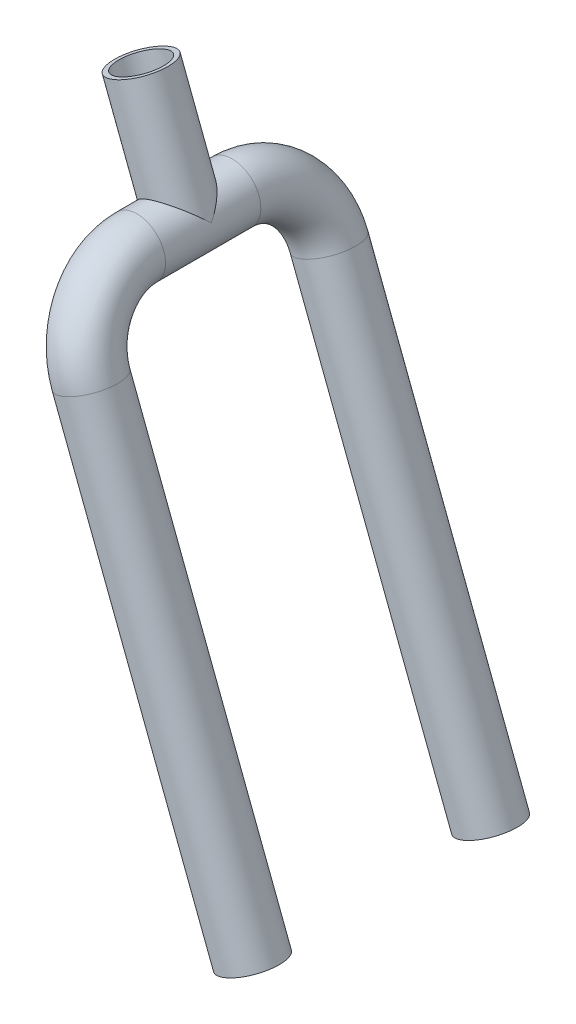
ISO-10303-21;
HEADER;
FILE_DESCRIPTION(('STEP AP214'),'2;1');
FILE_NAME('part.step','',(''),(''),'','','');
FILE_SCHEMA(('AUTOMOTIVE_DESIGN { 1 0 10303 214 1 1 1 1 }'));
ENDSEC;
DATA;
#1=APPLICATION_CONTEXT('core data for automotive mechanical design processes');
#2=APPLICATION_PROTOCOL_DEFINITION('international standard','automotive_design',2000,#1);
#3=PRODUCT_CONTEXT('',#1,'mechanical');
#4=PRODUCT('Part','Part','',(#3));
#5=PRODUCT_RELATED_PRODUCT_CATEGORY('part','',(#4));
#6=PRODUCT_DEFINITION_FORMATION('','',#4);
#7=PRODUCT_DEFINITION_CONTEXT('part definition',#1,'design');
#8=PRODUCT_DEFINITION('design','',#6,#7);
#9=PRODUCT_DEFINITION_SHAPE('','',#8);
#10=(LENGTH_UNIT() NAMED_UNIT(*) SI_UNIT(.MILLI.,.METRE.));
#11=(NAMED_UNIT(*) PLANE_ANGLE_UNIT() SI_UNIT($,.RADIAN.));
#12=(NAMED_UNIT(*) SI_UNIT($,.STERADIAN.) SOLID_ANGLE_UNIT());
#13=UNCERTAINTY_MEASURE_WITH_UNIT(LENGTH_MEASURE(1.E-05),#10,'distance_accuracy_value','');
#14=(GEOMETRIC_REPRESENTATION_CONTEXT(3) GLOBAL_UNCERTAINTY_ASSIGNED_CONTEXT((#13)) GLOBAL_UNIT_ASSIGNED_CONTEXT((#10,
#11,#12)) REPRESENTATION_CONTEXT('',''));
#15=CARTESIAN_POINT('',(0.,0.,0.));
#16=DIRECTION('',(0.,0.,1.));
#17=DIRECTION('',(1.,0.,0.));
#18=AXIS2_PLACEMENT_3D('',#15,#16,#17);
#19=CARTESIAN_POINT('',(310.374349965764,-65.3908633930521,1.17961196366423E-13));
#20=DIRECTION('',(0.356867031977588,-0.934155191329314,0.));
#21=DIRECTION('',(0.934155191329314,0.356867031977588,0.));
#22=AXIS2_PLACEMENT_3D('',#19,#20,#21);
#23=CYLINDRICAL_SURFACE('',#22,12.);
#24=CARTESIAN_POINT('',(310.374349965764,-65.3908633930521,1.17961196366423E-13));
#25=DIRECTION('',(-0.356867031977589,0.934155191329314,0.));
#26=DIRECTION('',(-0.934155191329314,-0.356867031977589,0.));
#27=AXIS2_PLACEMENT_3D('',#24,#25,#26);
#28=CIRCLE('',#27,12.);
#29=CARTESIAN_POINT('',(299.164487669812,-69.6732677767832,1.17961196366423E-13));
#30=VERTEX_POINT('',#29);
#31=EDGE_CURVE('E75',#30,#30,#28,.T.);
#32=ORIENTED_EDGE('',*,*,#31,.F.);
#33=EDGE_LOOP('',(#32));
#34=FACE_BOUND('',#33,.T.);
#35=CARTESIAN_POINT('',(328.626593604482,-113.168961734137,-1.09625249990243E-13));
#36=DIRECTION('',(0.252343098293269,-0.660547470469575,-0.707106781186547));
#37=DIRECTION('',(-0.252343098293269,0.660547470469574,-0.707106781186547));
#38=AXIS2_PLACEMENT_3D('',#35,#36,#37);
#39=ELLIPSE('',#38,16.9705627484771,12.);
#40=CARTESIAN_POINT('',(317.416731308531,-117.451366117868,0.));
#41=VERTEX_POINT('',#40);
#42=CARTESIAN_POINT('',(339.836455900434,-108.886557350406,1.18412093695566E-13));
#43=VERTEX_POINT('',#42);
#44=EDGE_CURVE('E81',#41,#43,#39,.T.);
#45=ORIENTED_EDGE('',*,*,#44,.F.);
#46=CARTESIAN_POINT('',(328.626593604482,-113.168961734137,1.09625249990243E-13));
#47=DIRECTION('',(0.252343098293269,-0.660547470469575,0.707106781186547));
#48=DIRECTION('',(-0.252343098293269,0.660547470469574,0.707106781186547));
#49=AXIS2_PLACEMENT_3D('',#46,#47,#48);
#50=ELLIPSE('',#49,16.9705627484771,12.);
#51=EDGE_CURVE('E12',#43,#41,#50,.T.);
#52=ORIENTED_EDGE('',*,*,#51,.F.);
#53=EDGE_LOOP('',(#45,#52));
#54=FACE_BOUND('',#53,.T.);
#55=ADVANCED_FACE('F60',(#34,#54),#23,.T.);
#56=CARTESIAN_POINT('',(328.626593604482,-113.168961734137,-22.1000000000001));
#57=DIRECTION('',(0.,0.,1.));
#58=DIRECTION('',(1.,0.,0.));
#59=AXIS2_PLACEMENT_3D('',#56,#57,#58);
#60=CYLINDRICAL_SURFACE('',#59,9.99999999999997);
#61=CARTESIAN_POINT('',(328.626593604482,-113.168961734137,20.0000000000001));
#62=DIRECTION('',(0.,0.,-1.));
#63=DIRECTION('',(-0.934155191329314,-0.356867031977588,0.));
#64=AXIS2_PLACEMENT_3D('',#61,#62,#63);
#65=CIRCLE('',#64,9.99999999999997);
#66=CARTESIAN_POINT('',(325.057923284707,-103.827409820844,20.0000000000001));
#67=VERTEX_POINT('',#66);
#68=EDGE_CURVE('E346',#67,#67,#65,.T.);
#69=ORIENTED_EDGE('',*,*,#68,.F.);
#70=EDGE_LOOP('',(#69));
#71=FACE_BOUND('',#70,.T.);
#72=CARTESIAN_POINT('',(338.626593604482,-113.168961734137,7.53229100946376));
#73=CARTESIAN_POINT('',(338.626589763019,-113.484171813911,7.67180583477984));
#74=CARTESIAN_POINT('',(338.611726397505,-113.795319161676,7.82028637291831));
#75=CARTESIAN_POINT('',(338.554088352381,-114.410026195121,8.1275508557588));
#76=CARTESIAN_POINT('',(338.511291185787,-114.713579562976,8.28634300859242));
#77=CARTESIAN_POINT('',(338.398586543403,-115.314129597418,8.60881229461179));
#78=CARTESIAN_POINT('',(338.328597900084,-115.611103792707,8.77250268607406));
#79=CARTESIAN_POINT('',(338.161851545996,-116.197445018467,9.09965396096389));
#80=CARTESIAN_POINT('',(338.065101935073,-116.486814321766,9.2631148988185));
#81=CARTESIAN_POINT('',(337.844523091155,-117.057864871613,9.58614681882761));
#82=CARTESIAN_POINT('',(337.720659406337,-117.339535819546,9.74571256230586));
#83=CARTESIAN_POINT('',(337.445462886541,-117.893709828017,10.0571442340156));
#84=CARTESIAN_POINT('',(337.294125294118,-118.166211291044,10.2090088228619));
#85=CARTESIAN_POINT('',(336.964031739382,-118.699342596713,10.5009872355122));
#86=CARTESIAN_POINT('',(336.785363019411,-118.960006906426,10.6411363286413));
#87=CARTESIAN_POINT('',(336.400012408152,-119.4678040171,10.9065677492897));
#88=CARTESIAN_POINT('',(336.193345052597,-119.714943746608,11.0318577281645));
#89=CARTESIAN_POINT('',(335.820825843123,-120.118295191428,11.2278463985707));
#90=CARTESIAN_POINT('',(335.662247649001,-120.278897508977,11.303410601493));
#91=CARTESIAN_POINT('',(335.332212353992,-120.590970840015,11.4445499183444));
#92=CARTESIAN_POINT('',(335.160758671904,-120.742444258359,11.5101276700484));
#93=CARTESIAN_POINT('',(334.805556689963,-121.03492131751,11.6301275409872));
#94=CARTESIAN_POINT('',(334.621813142466,-121.175928961326,11.6845539396262));
#95=CARTESIAN_POINT('',(334.242796383365,-121.44618536124,11.7812283468518));
#96=CARTESIAN_POINT('',(334.047522851477,-121.575433790433,11.8234760169418));
#97=CARTESIAN_POINT('',(333.645447918093,-121.82153188279,11.8951019602312));
#98=CARTESIAN_POINT('',(333.438586653465,-121.938305928738,11.924404788497));
#99=CARTESIAN_POINT('',(333.015860845385,-122.157342874665,11.9691146112919));
#100=CARTESIAN_POINT('',(332.799996322599,-122.259605807953,11.9845216377166));
#101=CARTESIAN_POINT('',(332.361068362138,-122.448551024011,12.0010716221193));
#102=CARTESIAN_POINT('',(332.138006305354,-122.535236274738,12.0022173001038));
#103=CARTESIAN_POINT('',(331.68659257531,-122.692275559668,11.9902225686271));
#104=CARTESIAN_POINT('',(331.458241217419,-122.762630564799,11.9770830087699));
#105=CARTESIAN_POINT('',(331.018627905023,-122.881084459179,11.9386201390567));
#106=CARTESIAN_POINT('',(330.80764160177,-122.93060179112,11.914477728772));
#107=CARTESIAN_POINT('',(330.384352230874,-123.015631201067,11.8550446762054));
#108=CARTESIAN_POINT('',(330.172048741892,-123.051138535137,11.8197502650083));
#109=CARTESIAN_POINT('',(329.74765996961,-123.108229458829,11.7386683632756));
#110=CARTESIAN_POINT('',(329.535574638839,-123.129817398832,11.6928841572992));
#111=CARTESIAN_POINT('',(329.112724364647,-123.15938831132,11.5915732154755));
#112=CARTESIAN_POINT('',(328.901959949205,-123.167366151221,11.536042812885));
#113=CARTESIAN_POINT('',(328.471698939045,-123.170197580737,11.4129024245151));
#114=CARTESIAN_POINT('',(328.252336882049,-123.164327759883,11.3448058137348));
#115=CARTESIAN_POINT('',(327.81734594446,-123.138547935157,11.1998243930018));
#116=CARTESIAN_POINT('',(327.601718565883,-123.118632410815,11.1229361375736));
#117=CARTESIAN_POINT('',(326.961657664653,-123.038750497619,10.8806611451848));
#118=CARTESIAN_POINT('',(326.543936283196,-122.958648881244,10.7036321717294));
#119=CARTESIAN_POINT('',(325.838829497353,-122.777496876574,10.3770783719235));
#120=CARTESIAN_POINT('',(325.546084446191,-122.687514433541,10.2325834659381));
#121=CARTESIAN_POINT('',(324.973787202938,-122.482893244921,9.93478798481263));
#122=CARTESIAN_POINT('',(324.694240680018,-122.368244019598,9.78148368733595));
#123=CARTESIAN_POINT('',(324.14849657261,-122.115321686843,9.4691447982308));
#124=CARTESIAN_POINT('',(323.882330750781,-121.976995512217,9.31009798187645));
#125=CARTESIAN_POINT('',(323.364341464427,-121.677672964465,8.99015981791156));
#126=CARTESIAN_POINT('',(323.11251450566,-121.516682147985,8.82926893126279));
#127=CARTESIAN_POINT('',(322.659170189583,-121.197352602385,8.53303260666917));
#128=CARTESIAN_POINT('',(322.455683340559,-121.042073147398,8.39739424371055));
#129=CARTESIAN_POINT('',(322.059418003785,-120.714707882957,8.13065097685777));
#130=CARTESIAN_POINT('',(321.866641414875,-120.542619108173,7.99954687839585));
#131=CARTESIAN_POINT('',(321.492685924246,-120.18143165365,7.74595501160012));
#132=CARTESIAN_POINT('',(321.311478823708,-119.992377263064,7.62344621528988));
#133=CARTESIAN_POINT('',(320.961058618337,-119.596211566105,7.39155024012015));
#134=CARTESIAN_POINT('',(320.791837561466,-119.389112438689,7.28215432763324));
#135=CARTESIAN_POINT('',(320.431887175554,-118.909561486385,7.06115903362332));
#136=CARTESIAN_POINT('',(320.244237741966,-118.63257809052,6.95403924319055));
#137=CARTESIAN_POINT('',(319.981084151325,-118.197273203431,6.82439325740273));
#138=CARTESIAN_POINT('',(319.896469268141,-118.048970465991,6.78636501812124));
#139=CARTESIAN_POINT('',(319.7340188431,-117.746250531445,6.72215813494575));
#140=CARTESIAN_POINT('',(319.656179807509,-117.591836545861,6.69597335480149));
#141=CARTESIAN_POINT('',(319.507319483769,-117.276221386052,6.65650697953526));
#142=CARTESIAN_POINT('',(319.43637371925,-117.114967975203,6.6433563326325));
#143=CARTESIAN_POINT('',(319.302954612811,-116.788471304091,6.63112858462126));
#144=CARTESIAN_POINT('',(319.240480824887,-116.623228254401,6.63205074236739));
#145=CARTESIAN_POINT('',(319.124525293708,-116.290150720479,6.64792258439299));
#146=CARTESIAN_POINT('',(319.071050329812,-116.122314385574,6.66288278908353));
#147=CARTESIAN_POINT('',(318.97342216899,-115.78564312116,6.70603823928555));
#148=CARTESIAN_POINT('',(318.929270417708,-115.616808040954,6.7342355351381));
#149=CARTESIAN_POINT('',(318.843334729031,-115.249674983019,6.8085200834707));
#150=CARTESIAN_POINT('',(318.803335556125,-115.05142201435,6.85688269989488));
#151=CARTESIAN_POINT('',(318.735826127546,-114.65654561825,6.96736661682238));
#152=CARTESIAN_POINT('',(318.708325812501,-114.459923609537,7.02949881037299));
#153=CARTESIAN_POINT('',(318.665202490302,-114.068698854289,7.16492680065282));
#154=CARTESIAN_POINT('',(318.649611272783,-113.87410287057,7.23825185422052));
#155=CARTESIAN_POINT('',(318.629809689433,-113.487862552535,7.39341724620991));
#156=CARTESIAN_POINT('',(318.625596569867,-113.296217515195,7.47525551927713));
#157=CARTESIAN_POINT('',(318.628689407725,-112.804007306253,7.69531948253971));
#158=CARTESIAN_POINT('',(318.644224645223,-112.505652990336,7.83840732876916));
#159=CARTESIAN_POINT('',(318.700973996099,-111.916026437965,8.13386391465272));
#160=CARTESIAN_POINT('',(318.742202381246,-111.624758231123,8.28623776993565));
#161=CARTESIAN_POINT('',(318.849554849022,-111.048718312547,8.59531673802817));
#162=CARTESIAN_POINT('',(318.915710615317,-110.763955359869,8.75202712686791));
#163=CARTESIAN_POINT('',(319.072603835049,-110.20138236173,9.06546755198144));
#164=CARTESIAN_POINT('',(319.163336404421,-109.923570946783,9.22219757817384));
#165=CARTESIAN_POINT('',(319.373373360448,-109.364984333964,9.53804936224931));
#166=CARTESIAN_POINT('',(319.493621342945,-109.084488457514,9.69704051797406));
#167=CARTESIAN_POINT('',(319.761139636039,-108.532388442919,10.0077989944249));
#168=CARTESIAN_POINT('',(319.908414622027,-108.260785852814,10.1595650595556));
#169=CARTESIAN_POINT('',(320.230057797878,-107.728875040707,10.4520036433285));
#170=CARTESIAN_POINT('',(320.404359095962,-107.468540910604,10.5927022922514));
#171=CARTESIAN_POINT('',(320.780597997259,-106.960898983082,10.859853953605));
#172=CARTESIAN_POINT('',(320.982522037875,-106.713584874931,10.986313901941));
#173=CARTESIAN_POINT('',(321.348731660222,-106.307232031007,11.1859295826452));
#174=CARTESIAN_POINT('',(321.505990727856,-106.14407354513,11.263655811169));
#175=CARTESIAN_POINT('',(321.83362639437,-105.826784549289,11.4091991129172));
#176=CARTESIAN_POINT('',(322.003999563278,-105.67265169713,11.4770187638343));
#177=CARTESIAN_POINT('',(322.357300190246,-105.374776754331,11.6015425746027));
#178=CARTESIAN_POINT('',(322.540221682557,-105.231029791845,11.6582519677406));
#179=CARTESIAN_POINT('',(322.917901976941,-104.955222683503,11.7594990001698));
#180=CARTESIAN_POINT('',(323.112661085267,-104.823162840225,11.8040363243912));
#181=CARTESIAN_POINT('',(323.514111915047,-104.57134529812,11.8802254189314));
#182=CARTESIAN_POINT('',(323.720869151096,-104.451667516491,11.9117969685809));
#183=CARTESIAN_POINT('',(324.143752999309,-104.226843556653,11.960936903738));
#184=CARTESIAN_POINT('',(324.359879595776,-104.121697354097,11.9785053127062));
#185=CARTESIAN_POINT('',(324.799687390263,-103.927067803824,11.9992145835099));
#186=CARTESIAN_POINT('',(325.023366821068,-103.837580822038,12.0023587970816));
#187=CARTESIAN_POINT('',(325.476358178866,-103.675073771866,11.9941501990527));
#188=CARTESIAN_POINT('',(325.705669733156,-103.602052617094,11.9827983442053));
#189=CARTESIAN_POINT('',(326.146288703288,-103.478996108376,11.9476045270564));
#190=CARTESIAN_POINT('',(326.357279171283,-103.427451593043,11.9250270632346));
#191=CARTESIAN_POINT('',(326.780783369539,-103.338406348836,11.8686172952186));
#192=CARTESIAN_POINT('',(326.99329758973,-103.300910364207,11.834781196208));
#193=CARTESIAN_POINT('',(327.418306985641,-103.239907049377,11.7564859159368));
#194=CARTESIAN_POINT('',(327.630802153803,-103.216396383057,11.7120292716968));
#195=CARTESIAN_POINT('',(328.054628595218,-103.183068275754,11.6132335447811));
#196=CARTESIAN_POINT('',(328.265959398155,-103.17325601419,11.5588907328813));
#197=CARTESIAN_POINT('',(328.696291862998,-103.166781182208,11.4383812730729));
#198=CARTESIAN_POINT('',(328.915180125406,-103.170766438256,11.3717750947005));
#199=CARTESIAN_POINT('',(329.349377077678,-103.192745129391,11.229705016505));
#200=CARTESIAN_POINT('',(329.564684329587,-103.210744059279,11.154237652044));
#201=CARTESIAN_POINT('',(330.203815073776,-103.284826473281,10.9161644508458));
#202=CARTESIAN_POINT('',(330.621139608896,-103.360992803062,10.7418036392201));
#203=CARTESIAN_POINT('',(331.325243593668,-103.535067851445,10.419842720157));
#204=CARTESIAN_POINT('',(331.617312717482,-103.621867318845,10.2773941798534));
#205=CARTESIAN_POINT('',(332.188509801944,-103.819946220552,9.98347104388505));
#206=CARTESIAN_POINT('',(332.467632480365,-103.931235542318,9.83199282066549));
#207=CARTESIAN_POINT('',(333.013279938414,-104.17746578502,9.52271507071044));
#208=CARTESIAN_POINT('',(333.279747379896,-104.312503323735,9.36489183469433));
#209=CARTESIAN_POINT('',(333.798514260618,-104.605089710884,9.04699258920519));
#210=CARTESIAN_POINT('',(334.050816126094,-104.762634687828,8.88691697142301));
#211=CARTESIAN_POINT('',(334.545605389452,-105.103158783915,8.56542477480938));
#212=CARTESIAN_POINT('',(334.787827152795,-105.286552171269,8.40403762915743));
#213=CARTESIAN_POINT('',(335.257257181791,-105.677127642336,8.08776953043228));
#214=CARTESIAN_POINT('',(335.484456725316,-105.884323358228,7.93289237584071));
#215=CARTESIAN_POINT('',(335.921759459393,-106.322366157856,7.63703896319819));
#216=CARTESIAN_POINT('',(336.131949755626,-106.55307698283,7.49599097826109));
#217=CARTESIAN_POINT('',(336.53484744318,-107.040411310566,7.23560127150269));
#218=CARTESIAN_POINT('',(336.727581925956,-107.296993306146,7.11622561451312));
#219=CARTESIAN_POINT('',(337.000088584019,-107.699917819928,6.96243650761092));
#220=CARTESIAN_POINT('',(337.087656332337,-107.836317457144,6.91560380479042));
#221=CARTESIAN_POINT('',(337.257210009238,-108.115340828357,6.83143518745524));
#222=CARTESIAN_POINT('',(337.339198384285,-108.257961788794,6.7940950906802));
#223=CARTESIAN_POINT('',(337.496795518838,-108.548702114777,6.73037850918098));
#224=CARTESIAN_POINT('',(337.572416751697,-108.696809870822,6.70398017139962));
#225=CARTESIAN_POINT('',(337.716745628401,-108.997989183976,6.66320541964865));
#226=CARTESIAN_POINT('',(337.785453415442,-109.151060638187,6.64882875663144));
#227=CARTESIAN_POINT('',(337.915631615412,-109.461898963435,6.63275706246865));
#228=CARTESIAN_POINT('',(337.977060491025,-109.619686897907,6.6311316581695));
#229=CARTESIAN_POINT('',(338.091704402397,-109.937820919372,6.64082869774301));
#230=CARTESIAN_POINT('',(338.144919373909,-110.098167026364,6.65215124288638));
#231=CARTESIAN_POINT('',(338.242891080261,-110.420289687409,6.68720059485624));
#232=CARTESIAN_POINT('',(338.287637089953,-110.582067787262,6.71094298900244));
#233=CARTESIAN_POINT('',(338.368550267593,-110.905743798389,6.76974706854586));
#234=CARTESIAN_POINT('',(338.404713278236,-111.067641729776,6.80481421992586));
#235=CARTESIAN_POINT('',(338.501694715654,-111.558149344779,6.92642035979892));
#236=CARTESIAN_POINT('',(338.549207171322,-111.885589273893,7.02863182335554));
#237=CARTESIAN_POINT('',(338.611674686681,-112.533038858897,7.26163832331369));
#238=CARTESIAN_POINT('',(338.626597454609,-112.853040834583,7.39246156889959));
#239=CARTESIAN_POINT('',(338.626593604482,-113.168961734137,7.53229100946376));
#240=B_SPLINE_CURVE_WITH_KNOTS('',3,(#72,#73,#74,#75,#76,#77,#78,#79,#80,#81,#82,#83,#84,#85,
#86,#87,#88,#89,#90,#91,#92,#93,#94,#95,#96,#97,#98,#99,#100,#101,#102,#103,#104,#105,#106,#107,
#108,#109,#110,#111,#112,#113,#114,#115,#116,#117,#118,#119,#120,#121,#122,#123,#124,#125,#126,
#127,#128,#129,#130,#131,#132,#133,#134,#135,#136,#137,#138,#139,#140,#141,#142,#143,#144,#145,
#146,#147,#148,#149,#150,#151,#152,#153,#154,#155,#156,#157,#158,#159,#160,#161,#162,#163,#164,
#165,#166,#167,#168,#169,#170,#171,#172,#173,#174,#175,#176,#177,#178,#179,#180,#181,#182,#183,
#184,#185,#186,#187,#188,#189,#190,#191,#192,#193,#194,#195,#196,#197,#198,#199,#200,#201,#202,
#203,#204,#205,#206,#207,#208,#209,#210,#211,#212,#213,#214,#215,#216,#217,#218,#219,#220,#221,
#222,#223,#224,#225,#226,#227,#228,#229,#230,#231,#232,#233,#234,#235,#236,#237,#238,#239),
.UNSPECIFIED.,.T.,.F.,(4,2,2,2,2,2,2,2,2,2,2,2,2,2,2,2,2,2,2,2,2,2,2,2,2,2,2,2,2,2,2,2,2,2,2,2,
2,2,2,2,2,2,2,2,2,2,2,2,2,2,2,2,2,2,2,2,2,2,2,2,2,2,2,2,2,2,2,2,2,2,2,2,2,2,2,2,2,2,2,2,2,2,2,
4),(0.,1.03366952312707,2.06817218842973,3.1057869055251,4.1430879067434,5.18171465924484,
6.22052143454877,7.2560789344499,8.29110086133979,9.00448821858774,9.71768681695064,
10.4306112059589,11.1435554081404,11.8606016599185,12.5776462658356,13.2945541107901,
14.0114193205074,14.664855527546,15.3185128056304,15.9719656899165,16.6256649472631,
17.3142636166476,18.0031330811769,19.3805340139431,20.3952884599576,21.4104748809411,
22.4279671705767,23.4452104366833,24.3135972189509,25.1821374707519,26.0484729052802,
26.9142280864254,27.9641109736937,28.4883644944161,29.0123460805481,29.5415400800688,
30.0707062096406,30.6002692245575,31.1299142924897,31.7527882657878,32.3761567619446,
33.0011834917593,33.6260589386935,34.618338464827,35.6111696641826,36.605267070712,
37.5991670683946,38.6303266898309,39.6616648596257,40.6904899928109,41.718811780157,
42.436860462738,43.1547219748784,43.8722445340128,44.5897856642166,45.3117017411652,
46.0336166086193,46.7553637169175,47.4770631917345,48.1314105773129,48.7859787398971,
49.4403906962471,50.0950500212704,50.7808557410982,51.4669305028402,52.8381766999548,
53.846070524946,54.8543720229439,55.8668748461897,56.8792037187422,57.910139773944,
58.9416692432004,59.9675289376738,60.9917681895309,61.4975379831424,62.0030845565731,
62.5076165216154,63.0121380342383,63.5194125266588,64.0266909866882,64.5346076307772,
65.0427697921232,66.0777452594238,67.1137457763556),.UNSPECIFIED.);
#241=CARTESIAN_POINT('',(338.626593604482,-113.168961734137,7.53229100946376));
#242=VERTEX_POINT('',#241);
#243=EDGE_CURVE('E65',#242,#242,#240,.T.);
#244=ORIENTED_EDGE('',*,*,#243,.T.);
#245=EDGE_LOOP('',(#244));
#246=FACE_BOUND('',#245,.T.);
#247=ADVANCED_FACE('F168',(#71,#246),#60,.F.);
#248=CARTESIAN_POINT('',(407.137340639552,-318.683103826586,50.));
#249=DIRECTION('',(-0.356867031977589,0.934155191329314,0.));
#250=DIRECTION('',(-0.934155191329314,-0.356867031977589,0.));
#251=AXIS2_PLACEMENT_3D('',#248,#249,#250);
#252=PLANE('',#251);
#253=CARTESIAN_POINT('',(407.137340639552,-318.683103826586,50.));
#254=DIRECTION('',(-0.356867031977589,0.934155191329314,0.));
#255=DIRECTION('',(-0.934155191329314,-0.356867031977589,0.));
#256=AXIS2_PLACEMENT_3D('',#253,#254,#255);
#257=CIRCLE('',#256,9.99999999999997);
#258=CARTESIAN_POINT('',(397.795788726259,-322.251774146362,50.));
#259=VERTEX_POINT('',#258);
#260=EDGE_CURVE('E352',#259,#259,#257,.T.);
#261=ORIENTED_EDGE('',*,*,#260,.T.);
#262=EDGE_LOOP('',(#261));
#263=FACE_BOUND('',#262,.T.);
#264=CARTESIAN_POINT('',(407.137340639552,-318.683103826586,50.));
#265=DIRECTION('',(-0.356867031977589,0.934155191329314,0.));
#266=DIRECTION('',(-0.934155191329314,-0.356867031977589,0.));
#267=AXIS2_PLACEMENT_3D('',#264,#265,#266);
#268=CIRCLE('',#267,12.);
#269=CARTESIAN_POINT('',(395.9274783436,-322.965508210317,50.));
#270=VERTEX_POINT('',#269);
#271=EDGE_CURVE('E96',#270,#270,#268,.T.);
#272=ORIENTED_EDGE('',*,*,#271,.F.);
#273=EDGE_LOOP('',(#272));
#274=FACE_BOUND('',#273,.T.);
#275=ADVANCED_FACE('F157',(#263,#274),#252,.F.);
#276=CARTESIAN_POINT('',(310.374349965764,-65.3908633930521,1.17961196366423E-13));
#277=DIRECTION('',(-0.356867031977589,0.934155191329314,0.));
#278=DIRECTION('',(-0.934155191329314,-0.356867031977589,0.));
#279=AXIS2_PLACEMENT_3D('',#276,#277,#278);
#280=PLANE('',#279);
#281=CARTESIAN_POINT('',(310.374349965764,-65.3908633930521,1.17961196366423E-13));
#282=DIRECTION('',(-0.356867031977589,0.934155191329314,0.));
#283=DIRECTION('',(-0.934155191329314,-0.356867031977589,0.));
#284=AXIS2_PLACEMENT_3D('',#281,#282,#283);
#285=CIRCLE('',#284,9.99999999999997);
#286=CARTESIAN_POINT('',(301.032798052471,-68.959533712828,1.17961196366423E-13));
#287=VERTEX_POINT('',#286);
#288=EDGE_CURVE('E97',#287,#287,#285,.T.);
#289=ORIENTED_EDGE('',*,*,#288,.F.);
#290=EDGE_LOOP('',(#289));
#291=FACE_BOUND('',#290,.T.);
#292=ORIENTED_EDGE('',*,*,#31,.T.);
#293=EDGE_LOOP('',(#292));
#294=FACE_BOUND('',#293,.T.);
#295=ADVANCED_FACE('F169',(#291,#294),#280,.T.);
#296=CARTESIAN_POINT('',(328.626593604482,-113.168961734137,-22.1000000000001));
#297=DIRECTION('',(0.,0.,1.));
#298=DIRECTION('',(1.,0.,0.));
#299=AXIS2_PLACEMENT_3D('',#296,#297,#298);
#300=CYLINDRICAL_SURFACE('',#299,12.);
#301=ORIENTED_EDGE('',*,*,#44,.T.);
#302=ORIENTED_EDGE('',*,*,#51,.T.);
#303=EDGE_LOOP('',(#301,#302));
#304=FACE_BOUND('',#303,.T.);
#305=CARTESIAN_POINT('',(328.626593604482,-113.168961734137,-20.0000000000001));
#306=DIRECTION('',(0.,0.,-1.));
#307=DIRECTION('',(-1.,0.,0.));
#308=AXIS2_PLACEMENT_3D('',#305,#306,#307);
#309=CIRCLE('',#308,12.);
#310=CARTESIAN_POINT('',(324.344189220751,-101.959099438185,-20.0000000000001));
#311=VERTEX_POINT('',#310);
#312=EDGE_CURVE('E118',#311,#311,#309,.F.);
#313=ORIENTED_EDGE('',*,*,#312,.T.);
#314=EDGE_LOOP('',(#313));
#315=FACE_BOUND('',#314,.T.);
#316=CARTESIAN_POINT('',(328.626593604482,-113.168961734137,20.0000000000001));
#317=DIRECTION('',(0.,0.,1.));
#318=DIRECTION('',(1.,0.,0.));
#319=AXIS2_PLACEMENT_3D('',#316,#317,#318);
#320=CIRCLE('',#319,12.);
#321=CARTESIAN_POINT('',(324.344189220751,-101.959099438185,20.0000000000001));
#322=VERTEX_POINT('',#321);
#323=EDGE_CURVE('E335',#322,#322,#320,.F.);
#324=ORIENTED_EDGE('',*,*,#323,.T.);
#325=EDGE_LOOP('',(#324));
#326=FACE_BOUND('',#325,.T.);
#327=ADVANCED_FACE('F172',(#304,#315,#326),#300,.T.);
#328=CARTESIAN_POINT('',(339.33260456381,-141.193617474016,20.));
#329=DIRECTION('',(0.934155191329314,0.356867031977588,0.));
#330=DIRECTION('',(-0.356867031977588,0.934155191329314,0.));
#331=AXIS2_PLACEMENT_3D('',#328,#329,#330);
#332=TOROIDAL_SURFACE('',#331,30.,12.);
#333=CARTESIAN_POINT('',(339.33260456381,-141.193617474016,50.));
#334=DIRECTION('',(-0.356867031977588,0.934155191329314,0.));
#335=DIRECTION('',(-0.934155191329314,-0.356867031977588,0.));
#336=AXIS2_PLACEMENT_3D('',#333,#334,#335);
#337=CIRCLE('',#336,12.);
#338=CARTESIAN_POINT('',(339.33260456381,-141.193617474016,62.));
#339=VERTEX_POINT('',#338);
#340=EDGE_CURVE('E337',#339,#339,#337,.T.);
#341=CARTESIAN_POINT('',(339.33260456381,-141.193617474016,20.));
#342=DIRECTION('',(0.934155191329314,0.356867031977588,0.));
#343=DIRECTION('',(-0.356867031977588,0.934155191329314,0.));
#344=AXIS2_PLACEMENT_3D('',#341,#342,#343);
#345=CIRCLE('',#344,42.);
#346=EDGE_CURVE('',#322,#339,#345,.T.);
#347=ORIENTED_EDGE('',*,*,#323,.F.);
#348=ORIENTED_EDGE('',*,*,#340,.T.);
#349=ORIENTED_EDGE('',*,*,#346,.T.);
#350=ORIENTED_EDGE('',*,*,#346,.F.);
#351=EDGE_LOOP('',(#347,#349,#348,#350));
#352=FACE_BOUND('',#351,.T.);
#353=ADVANCED_FACE('F179',(#352),#332,.T.);
#354=CARTESIAN_POINT('',(339.33260456381,-141.193617474017,50.));
#355=DIRECTION('',(0.356867031977588,-0.934155191329314,0.));
#356=DIRECTION('',(0.934155191329314,0.356867031977588,0.));
#357=AXIS2_PLACEMENT_3D('',#354,#355,#356);
#358=CYLINDRICAL_SURFACE('',#357,12.);
#359=ORIENTED_EDGE('',*,*,#271,.T.);
#360=EDGE_LOOP('',(#359));
#361=FACE_BOUND('',#360,.T.);
#362=ORIENTED_EDGE('',*,*,#340,.F.);
#363=EDGE_LOOP('',(#362));
#364=FACE_BOUND('',#363,.T.);
#365=ADVANCED_FACE('F167',(#361,#364),#358,.T.);
#366=CARTESIAN_POINT('',(328.626593604482,-113.168961734137,-1.11697644469923E-13));
#367=DIRECTION('',(0.252343098293269,-0.660547470469575,-0.707106781186547));
#368=DIRECTION('',(0.252343098293269,-0.660547470469575,0.707106781186548));
#369=AXIS2_PLACEMENT_3D('',#366,#367,#368);
#370=ELLIPSE('',#369,14.1421356237309,9.99999999999997);
#371=CARTESIAN_POINT('',(337.968145517776,-109.600291414361,0.));
#372=VERTEX_POINT('',#371);
#373=CARTESIAN_POINT('',(319.285041691189,-116.737632053913,0.));
#374=VERTEX_POINT('',#373);
#375=EDGE_CURVE('E88',#372,#374,#370,.T.);
#376=ORIENTED_EDGE('',*,*,#375,.F.);
#377=CARTESIAN_POINT('',(328.626593604482,-113.168961734137,1.11697644469923E-13));
#378=DIRECTION('',(0.252343098293269,-0.660547470469575,0.707106781186547));
#379=DIRECTION('',(0.252343098293269,-0.660547470469575,-0.707106781186548));
#380=AXIS2_PLACEMENT_3D('',#377,#378,#379);
#381=ELLIPSE('',#380,14.1421356237309,9.99999999999997);
#382=EDGE_CURVE('E93',#374,#372,#381,.T.);
#383=ORIENTED_EDGE('',*,*,#382,.F.);
#384=EDGE_LOOP('',(#376,#383));
#385=FACE_BOUND('',#384,.T.);
#386=ADVANCED_FACE('F94',(#385),#60,.F.);
#387=CARTESIAN_POINT('',(339.33260456381,-141.193617474016,20.));
#388=DIRECTION('',(0.934155191329314,0.356867031977588,0.));
#389=DIRECTION('',(-0.356867031977588,0.934155191329314,0.));
#390=AXIS2_PLACEMENT_3D('',#387,#388,#389);
#391=TOROIDAL_SURFACE('',#390,30.,9.99999999999997);
#392=CARTESIAN_POINT('',(339.33260456381,-141.193617474016,50.));
#393=DIRECTION('',(-0.356867031977589,0.934155191329314,0.));
#394=DIRECTION('',(-0.934155191329314,-0.356867031977589,0.));
#395=AXIS2_PLACEMENT_3D('',#392,#393,#394);
#396=CIRCLE('',#395,9.99999999999997);
#397=CARTESIAN_POINT('',(339.33260456381,-141.193617474016,60.));
#398=VERTEX_POINT('',#397);
#399=EDGE_CURVE('E349',#398,#398,#396,.T.);
#400=CARTESIAN_POINT('',(339.33260456381,-141.193617474016,20.));
#401=DIRECTION('',(0.934155191329314,0.356867031977588,0.));
#402=DIRECTION('',(-0.356867031977588,0.934155191329314,0.));
#403=AXIS2_PLACEMENT_3D('',#400,#401,#402);
#404=CIRCLE('',#403,40.);
#405=EDGE_CURVE('',#67,#398,#404,.T.);
#406=ORIENTED_EDGE('',*,*,#68,.T.);
#407=ORIENTED_EDGE('',*,*,#399,.F.);
#408=ORIENTED_EDGE('',*,*,#405,.T.);
#409=ORIENTED_EDGE('',*,*,#405,.F.);
#410=EDGE_LOOP('',(#406,#408,#407,#409));
#411=FACE_BOUND('',#410,.T.);
#412=ADVANCED_FACE('F160',(#411),#391,.F.);
#413=CARTESIAN_POINT('',(339.33260456381,-141.193617474017,50.));
#414=DIRECTION('',(0.356867031977588,-0.934155191329314,0.));
#415=DIRECTION('',(0.934155191329314,0.356867031977588,0.));
#416=AXIS2_PLACEMENT_3D('',#413,#414,#415);
#417=CYLINDRICAL_SURFACE('',#416,9.99999999999997);
#418=ORIENTED_EDGE('',*,*,#260,.F.);
#419=EDGE_LOOP('',(#418));
#420=FACE_BOUND('',#419,.T.);
#421=ORIENTED_EDGE('',*,*,#399,.T.);
#422=EDGE_LOOP('',(#421));
#423=FACE_BOUND('',#422,.T.);
#424=ADVANCED_FACE('F156',(#420,#423),#417,.F.);
#425=CARTESIAN_POINT('',(310.374349965764,-65.3908633930521,1.17961196366423E-13));
#426=DIRECTION('',(0.356867031977588,-0.934155191329314,0.));
#427=DIRECTION('',(0.934155191329314,0.356867031977588,0.));
#428=AXIS2_PLACEMENT_3D('',#425,#426,#427);
#429=CYLINDRICAL_SURFACE('',#428,9.99999999999997);
#430=ORIENTED_EDGE('',*,*,#382,.T.);
#431=ORIENTED_EDGE('',*,*,#375,.T.);
#432=EDGE_LOOP('',(#430,#431));
#433=FACE_BOUND('',#432,.T.);
#434=ORIENTED_EDGE('',*,*,#288,.T.);
#435=EDGE_LOOP('',(#434));
#436=FACE_BOUND('',#435,.T.);
#437=ADVANCED_FACE('F99',(#433,#436),#429,.F.);
#438=CARTESIAN_POINT('',(310.374349965764,-65.3908633930521,-1.17961196366423E-13));
#439=DIRECTION('',(0.356867031977588,-0.934155191329314,0.));
#440=DIRECTION('',(0.934155191329314,0.356867031977588,0.));
#441=AXIS2_PLACEMENT_3D('',#438,#439,#440);
#442=CYLINDRICAL_SURFACE('',#441,12.);
#443=ORIENTED_EDGE('',*,*,#243,.F.);
#444=EDGE_LOOP('',(#443));
#445=FACE_BOUND('',#444,.T.);
#446=ADVANCED_FACE('F135',(#445),#442,.T.);
#447=CARTESIAN_POINT('',(328.626593604482,-113.168961734137,22.1000000000001));
#448=DIRECTION('',(0.,0.,-1.));
#449=DIRECTION('',(-1.,0.,0.));
#450=AXIS2_PLACEMENT_3D('',#447,#448,#449);
#451=CYLINDRICAL_SURFACE('',#450,9.99999999999997);
#452=CARTESIAN_POINT('',(328.626593604482,-113.168961734137,-20.0000000000001));
#453=DIRECTION('',(0.,0.,-1.));
#454=DIRECTION('',(-0.934155191329314,-0.356867031977588,0.));
#455=AXIS2_PLACEMENT_3D('',#452,#453,#454);
#456=CIRCLE('',#455,9.99999999999997);
#457=CARTESIAN_POINT('',(325.057923284707,-103.827409820844,-20.0000000000001));
#458=VERTEX_POINT('',#457);
#459=EDGE_CURVE('E102',#458,#458,#456,.F.);
#460=ORIENTED_EDGE('',*,*,#459,.F.);
#461=EDGE_LOOP('',(#460));
#462=FACE_BOUND('',#461,.T.);
#463=CARTESIAN_POINT('',(318.626593604482,-113.168961734137,-7.53229100946363));
#464=CARTESIAN_POINT('',(318.626597445946,-112.853751654363,-7.67180583477971));
#465=CARTESIAN_POINT('',(318.64146081146,-112.542604306598,-7.82028637291821));
#466=CARTESIAN_POINT('',(318.699098856583,-111.927897273153,-8.12755085575873));
#467=CARTESIAN_POINT('',(318.741896023178,-111.624343905298,-8.28634300859234));
#468=CARTESIAN_POINT('',(318.854600665562,-111.023793870857,-8.60881229461172));
#469=CARTESIAN_POINT('',(318.924589308881,-110.726819675568,-8.77250268607399));
#470=CARTESIAN_POINT('',(319.091335662969,-110.140478449808,-9.09965396096383));
#471=CARTESIAN_POINT('',(319.188085273892,-109.851109146508,-9.26311489881844));
#472=CARTESIAN_POINT('',(319.40866411781,-109.280058596662,-9.58614681882756));
#473=CARTESIAN_POINT('',(319.532527802628,-108.998387648729,-9.74571256230581));
#474=CARTESIAN_POINT('',(319.807724322424,-108.444213640257,-10.0571442340155));
#475=CARTESIAN_POINT('',(319.959061914847,-108.17171217723,-10.2090088228619));
#476=CARTESIAN_POINT('',(320.289155469583,-107.638580871561,-10.5009872355122));
#477=CARTESIAN_POINT('',(320.467824189554,-107.377916561849,-10.6411363286412));
#478=CARTESIAN_POINT('',(320.853174800813,-106.870119451175,-10.9065677492896));
#479=CARTESIAN_POINT('',(321.059842156368,-106.622979721666,-11.0318577281645));
#480=CARTESIAN_POINT('',(321.432361365842,-106.219628276846,-11.2278463985706));
#481=CARTESIAN_POINT('',(321.590939559964,-106.059025959297,-11.3034106014929));
#482=CARTESIAN_POINT('',(321.920974854973,-105.74695262826,-11.4445499183444));
#483=CARTESIAN_POINT('',(322.092428537061,-105.595479209915,-11.5101276700484));
#484=CARTESIAN_POINT('',(322.447630519002,-105.303002150764,-11.6301275409872));
#485=CARTESIAN_POINT('',(322.631374066498,-105.161994506948,-11.6845539396262));
#486=CARTESIAN_POINT('',(323.0103908256,-104.891738107034,-11.7812283468518));
#487=CARTESIAN_POINT('',(323.205664357488,-104.762489677841,-11.8234760169418));
#488=CARTESIAN_POINT('',(323.607739290872,-104.516391585484,-11.8951019602312));
#489=CARTESIAN_POINT('',(323.8146005555,-104.399617539536,-11.924404788497));
#490=CARTESIAN_POINT('',(324.23732636358,-104.180580593609,-11.9691146112919));
#491=CARTESIAN_POINT('',(324.453190886365,-104.078317660321,-11.9845216377165));
#492=CARTESIAN_POINT('',(324.892118846827,-103.889372444263,-12.0010716221193));
#493=CARTESIAN_POINT('',(325.115180903611,-103.802687193536,-12.0022173001038));
#494=CARTESIAN_POINT('',(325.566594633655,-103.645647908606,-11.990222568627));
#495=CARTESIAN_POINT('',(325.794945991546,-103.575292903475,-11.9770830087699));
#496=CARTESIAN_POINT('',(326.234559303942,-103.456839009095,-11.9386201390567));
#497=CARTESIAN_POINT('',(326.445545607195,-103.407321677154,-11.914477728772));
#498=CARTESIAN_POINT('',(326.868834978091,-103.322292267207,-11.8550446762054));
#499=CARTESIAN_POINT('',(327.081138467073,-103.286784933137,-11.8197502650083));
#500=CARTESIAN_POINT('',(327.505527239354,-103.229694009445,-11.7386683632756));
#501=CARTESIAN_POINT('',(327.717612570126,-103.208106069442,-11.6928841572992));
#502=CARTESIAN_POINT('',(328.140462844318,-103.178535156954,-11.5915732154755));
#503=CARTESIAN_POINT('',(328.35122725976,-103.170557317053,-11.536042812885));
#504=CARTESIAN_POINT('',(328.78148826992,-103.167725887537,-11.4129024245151));
#505=CARTESIAN_POINT('',(329.000850326916,-103.173595708391,-11.3448058137348));
#506=CARTESIAN_POINT('',(329.435841264505,-103.199375533117,-11.1998243930018));
#507=CARTESIAN_POINT('',(329.651468643082,-103.21929105746,-11.1229361375736));
#508=CARTESIAN_POINT('',(330.291529544312,-103.299172970655,-10.8806611451848));
#509=CARTESIAN_POINT('',(330.709250925769,-103.37927458703,-10.7036321717294));
#510=CARTESIAN_POINT('',(331.414357711612,-103.5604265917,-10.3770783719235));
#511=CARTESIAN_POINT('',(331.707102762774,-103.650409034733,-10.2325834659381));
#512=CARTESIAN_POINT('',(332.279400006027,-103.855030223353,-9.93478798481266));
#513=CARTESIAN_POINT('',(332.558946528947,-103.969679448676,-9.781483687336));
#514=CARTESIAN_POINT('',(333.104690636355,-104.222601781431,-9.46914479823085));
#515=CARTESIAN_POINT('',(333.370856458184,-104.360927956058,-9.3100979818765));
#516=CARTESIAN_POINT('',(333.888845744538,-104.660250503809,-8.99015981791161));
#517=CARTESIAN_POINT('',(334.140672703305,-104.821241320289,-8.82926893126285));
#518=CARTESIAN_POINT('',(334.594017019382,-105.140570865889,-8.53303260666925));
#519=CARTESIAN_POINT('',(334.797503868406,-105.295850320876,-8.39739424371064));
#520=CARTESIAN_POINT('',(335.193769205179,-105.623215585317,-8.13065097685788));
#521=CARTESIAN_POINT('',(335.38654579409,-105.795304360101,-7.99954687839595));
#522=CARTESIAN_POINT('',(335.760501284719,-106.156491814624,-7.74595501160023));
#523=CARTESIAN_POINT('',(335.941708385257,-106.345546205211,-7.62344621528999));
#524=CARTESIAN_POINT('',(336.292128590628,-106.741711902169,-7.39155024012025));
#525=CARTESIAN_POINT('',(336.461349647499,-106.948811029585,-7.28215432763333));
#526=CARTESIAN_POINT('',(336.82130003341,-107.42836198189,-7.0611590336234));
#527=CARTESIAN_POINT('',(337.008949466999,-107.705345377754,-6.95403924319065));
#528=CARTESIAN_POINT('',(337.27210305764,-108.140650264843,-6.82439325740281));
#529=CARTESIAN_POINT('',(337.356717940824,-108.288953002283,-6.78636501812132));
#530=CARTESIAN_POINT('',(337.519168365865,-108.591672936829,-6.72215813494583));
#531=CARTESIAN_POINT('',(337.597007401456,-108.746086922414,-6.69597335480158));
#532=CARTESIAN_POINT('',(337.745867725196,-109.061702082222,-6.65650697953535));
#533=CARTESIAN_POINT('',(337.816813489715,-109.222955493072,-6.64335633263259));
#534=CARTESIAN_POINT('',(337.950232596154,-109.549452164184,-6.63112858462136));
#535=CARTESIAN_POINT('',(338.012706384077,-109.714695213874,-6.63205074236749));
#536=CARTESIAN_POINT('',(338.128661915257,-110.047772747795,-6.64792258439309));
#537=CARTESIAN_POINT('',(338.182136879153,-110.2156090827,-6.66288278908363));
#538=CARTESIAN_POINT('',(338.279765039975,-110.552280347114,-6.70603823928564));
#539=CARTESIAN_POINT('',(338.323916791257,-110.72111542732,-6.7342355351382));
#540=CARTESIAN_POINT('',(338.409852479934,-111.088248485255,-6.80852008347081));
#541=CARTESIAN_POINT('',(338.449851652839,-111.286501453924,-6.85688269989499));
#542=CARTESIAN_POINT('',(338.517361081419,-111.681377850024,-6.96736661682249));
#543=CARTESIAN_POINT('',(338.544861396464,-111.877999858737,-7.0294988103731));
#544=CARTESIAN_POINT('',(338.587984718663,-112.269224613985,-7.16492680065294));
#545=CARTESIAN_POINT('',(338.603575936182,-112.463820597704,-7.23825185422064));
#546=CARTESIAN_POINT('',(338.623377519532,-112.850060915739,-7.39341724621005));
#547=CARTESIAN_POINT('',(338.627590639098,-113.041705953079,-7.47525551927727));
#548=CARTESIAN_POINT('',(338.62449780124,-113.533916162021,-7.69531948253986));
#549=CARTESIAN_POINT('',(338.608962563742,-113.832270477938,-7.8384073287693));
#550=CARTESIAN_POINT('',(338.552213212865,-114.421897030309,-8.13386391465287));
#551=CARTESIAN_POINT('',(338.510984827719,-114.713165237151,-8.2862377699358));
#552=CARTESIAN_POINT('',(338.403632359943,-115.289205155728,-8.59531673802833));
#553=CARTESIAN_POINT('',(338.337476593647,-115.573968108405,-8.75202712686808));
#554=CARTESIAN_POINT('',(338.180583373915,-116.136541106544,-9.06546755198161));
#555=CARTESIAN_POINT('',(338.089850804544,-116.414352521492,-9.222197578174));
#556=CARTESIAN_POINT('',(337.879813848517,-116.972939134311,-9.53804936224947));
#557=CARTESIAN_POINT('',(337.75956586602,-117.25343501076,-9.69704051797422));
#558=CARTESIAN_POINT('',(337.492047572926,-117.805535025356,-10.0077989944251));
#559=CARTESIAN_POINT('',(337.344772586937,-118.077137615461,-10.1595650595558));
#560=CARTESIAN_POINT('',(337.023129411086,-118.609048427567,-10.4520036433287));
#561=CARTESIAN_POINT('',(336.848828113003,-118.869382557671,-10.5927022922515));
#562=CARTESIAN_POINT('',(336.472589211705,-119.377024485192,-10.8598539536051));
#563=CARTESIAN_POINT('',(336.27066517109,-119.624338593344,-10.9863139019411));
#564=CARTESIAN_POINT('',(335.904455548742,-120.030691437267,-11.1859295826453));
#565=CARTESIAN_POINT('',(335.747196481109,-120.193849923144,-11.2636558111691));
#566=CARTESIAN_POINT('',(335.419560814595,-120.511138918986,-11.4091991129173));
#567=CARTESIAN_POINT('',(335.249187645686,-120.665271771145,-11.4770187638344));
#568=CARTESIAN_POINT('',(334.895887018719,-120.963146713943,-11.6015425746028));
#569=CARTESIAN_POINT('',(334.712965526408,-121.106893676429,-11.6582519677406));
#570=CARTESIAN_POINT('',(334.335285232024,-121.382700784771,-11.7594990001698));
#571=CARTESIAN_POINT('',(334.140526123698,-121.514760628049,-11.8040363243912));
#572=CARTESIAN_POINT('',(333.739075293917,-121.766578170155,-11.8802254189314));
#573=CARTESIAN_POINT('',(333.532318057869,-121.886255951783,-11.911796968581));
#574=CARTESIAN_POINT('',(333.109434209655,-122.111079911622,-11.960936903738));
#575=CARTESIAN_POINT('',(332.893307613188,-122.216226114178,-11.9785053127062));
#576=CARTESIAN_POINT('',(332.453499818701,-122.410855664451,-11.9992145835099));
#577=CARTESIAN_POINT('',(332.229820387897,-122.500342646236,-12.0023587970816));
#578=CARTESIAN_POINT('',(331.776829030098,-122.662849696408,-11.9941501990527));
#579=CARTESIAN_POINT('',(331.547517475809,-122.73587085118,-11.9827983442053));
#580=CARTESIAN_POINT('',(331.106898505677,-122.858927359898,-11.9476045270563));
#581=CARTESIAN_POINT('',(330.895908037682,-122.910471875231,-11.9250270632346));
#582=CARTESIAN_POINT('',(330.472403839426,-122.999517119438,-11.8686172952186));
#583=CARTESIAN_POINT('',(330.259889619235,-123.037013104067,-11.834781196208));
#584=CARTESIAN_POINT('',(329.834880223324,-123.098016418897,-11.7564859159367));
#585=CARTESIAN_POINT('',(329.622385055162,-123.121527085217,-11.7120292716968));
#586=CARTESIAN_POINT('',(329.198558613747,-123.15485519252,-11.6132335447811));
#587=CARTESIAN_POINT('',(328.98722781081,-123.164667454084,-11.5588907328813));
#588=CARTESIAN_POINT('',(328.556895345966,-123.171142286066,-11.4383812730728));
#589=CARTESIAN_POINT('',(328.338007083558,-123.167157030018,-11.3717750947005));
#590=CARTESIAN_POINT('',(327.903810131286,-123.145178338884,-11.2297050165049));
#591=CARTESIAN_POINT('',(327.688502879377,-123.127179408995,-11.154237652044));
#592=CARTESIAN_POINT('',(327.049372135188,-123.053096994993,-10.9161644508457));
#593=CARTESIAN_POINT('',(326.632047600069,-122.976930665212,-10.7418036392201));
#594=CARTESIAN_POINT('',(325.927943615297,-122.802855616829,-10.4198427201569));
#595=CARTESIAN_POINT('',(325.635874491483,-122.716056149429,-10.2773941798533));
#596=CARTESIAN_POINT('',(325.064677407021,-122.517977247723,-9.98347104388494));
#597=CARTESIAN_POINT('',(324.785554728599,-122.406687925957,-9.83199282066537));
#598=CARTESIAN_POINT('',(324.23990727055,-122.160457683254,-9.5227150707103));
#599=CARTESIAN_POINT('',(323.973439829069,-122.025420144539,-9.3648918346942));
#600=CARTESIAN_POINT('',(323.454672948347,-121.732833757391,-9.04699258920507));
#601=CARTESIAN_POINT('',(323.202371082871,-121.575288780446,-8.88691697142288));
#602=CARTESIAN_POINT('',(322.707581819513,-121.234764684359,-8.56542477480925));
#603=CARTESIAN_POINT('',(322.46536005617,-121.051371297005,-8.40403762915729));
#604=CARTESIAN_POINT('',(321.995930027173,-120.660795825938,-8.08776953043213));
#605=CARTESIAN_POINT('',(321.768730483648,-120.453600110046,-7.93289237584055));
#606=CARTESIAN_POINT('',(321.331427749572,-120.015557310418,-7.63703896319803));
#607=CARTESIAN_POINT('',(321.121237453339,-119.784846485444,-7.49599097826094));
#608=CARTESIAN_POINT('',(320.718339765785,-119.297512157708,-7.23560127150254));
#609=CARTESIAN_POINT('',(320.525605283009,-119.040930162128,-7.11622561451297));
#610=CARTESIAN_POINT('',(320.253098624946,-118.638005648346,-6.96243650761077));
#611=CARTESIAN_POINT('',(320.165530876627,-118.50160601113,-6.91560380479028));
#612=CARTESIAN_POINT('',(319.995977199727,-118.222582639917,-6.8314351874551));
#613=CARTESIAN_POINT('',(319.91398882468,-118.07996167948,-6.79409509068007));
#614=CARTESIAN_POINT('',(319.756391690127,-117.789221353497,-6.73037850918085));
#615=CARTESIAN_POINT('',(319.680770457267,-117.641113597453,-6.7039801713995));
#616=CARTESIAN_POINT('',(319.536441580564,-117.339934284298,-6.66320541964854));
#617=CARTESIAN_POINT('',(319.467733793522,-117.186862830087,-6.64882875663133));
#618=CARTESIAN_POINT('',(319.337555593552,-116.876024504839,-6.63275706246855));
#619=CARTESIAN_POINT('',(319.27612671794,-116.718236570367,-6.6311316581694));
#620=CARTESIAN_POINT('',(319.161482806568,-116.400102548902,-6.64082869774292));
#621=CARTESIAN_POINT('',(319.108267835056,-116.23975644191,-6.65215124288629));
#622=CARTESIAN_POINT('',(319.010296128704,-115.917633780865,-6.68720059485616));
#623=CARTESIAN_POINT('',(318.965550119012,-115.755855681012,-6.71094298900236));
#624=CARTESIAN_POINT('',(318.884636941372,-115.432179669885,-6.76974706854578));
#625=CARTESIAN_POINT('',(318.848473930729,-115.270281738498,-6.80481421992579));
#626=CARTESIAN_POINT('',(318.751492493311,-114.779774123495,-6.92642035979885));
#627=CARTESIAN_POINT('',(318.703980037643,-114.452334194381,-7.02863182335548));
#628=CARTESIAN_POINT('',(318.641512522284,-113.804884609377,-7.26163832331359));
#629=CARTESIAN_POINT('',(318.626589754356,-113.484882633691,-7.39246156889946));
#630=CARTESIAN_POINT('',(318.626593604482,-113.168961734137,-7.53229100946363));
#631=B_SPLINE_CURVE_WITH_KNOTS('',3,(#463,#464,#465,#466,#467,#468,#469,#470,#471,#472,#473,
#474,#475,#476,#477,#478,#479,#480,#481,#482,#483,#484,#485,#486,#487,#488,#489,#490,#491,#492,
#493,#494,#495,#496,#497,#498,#499,#500,#501,#502,#503,#504,#505,#506,#507,#508,#509,#510,#511,
#512,#513,#514,#515,#516,#517,#518,#519,#520,#521,#522,#523,#524,#525,#526,#527,#528,#529,#530,
#531,#532,#533,#534,#535,#536,#537,#538,#539,#540,#541,#542,#543,#544,#545,#546,#547,#548,#549,
#550,#551,#552,#553,#554,#555,#556,#557,#558,#559,#560,#561,#562,#563,#564,#565,#566,#567,#568,
#569,#570,#571,#572,#573,#574,#575,#576,#577,#578,#579,#580,#581,#582,#583,#584,#585,#586,#587,
#588,#589,#590,#591,#592,#593,#594,#595,#596,#597,#598,#599,#600,#601,#602,#603,#604,#605,#606,
#607,#608,#609,#610,#611,#612,#613,#614,#615,#616,#617,#618,#619,#620,#621,#622,#623,#624,#625,
#626,#627,#628,#629,#630),.UNSPECIFIED.,.T.,.F.,(4,2,2,2,2,2,2,2,2,2,2,2,2,2,2,2,2,2,2,2,2,2,2,
2,2,2,2,2,2,2,2,2,2,2,2,2,2,2,2,2,2,2,2,2,2,2,2,2,2,2,2,2,2,2,2,2,2,2,2,2,2,2,2,2,2,2,2,2,2,2,2,
2,2,2,2,2,2,2,2,2,2,2,2,4),(0.,1.03366952312707,2.06817218842975,3.10578690552512,
4.14308790674344,5.18171465924488,6.22052143454881,7.25607893444995,8.29110086133984,
9.00448821858779,9.71768681695069,10.430611205959,11.1435554081404,11.8606016599187,
12.5776462658356,13.2945541107902,14.0114193205076,14.6648555275461,15.3185128056304,
15.9719656899166,16.6256649472631,17.3142636166478,18.0031330811771,19.3805340139431,
20.3952884599577,21.4104748809411,22.4279671705768,23.4452104366833,24.3135972189508,
25.1821374707519,26.0484729052802,26.9142280864254,27.9641109736937,28.4883644944162,
29.0123460805481,29.5415400800688,30.0707062096406,30.6002692245575,31.1299142924897,
31.7527882657879,32.3761567619447,33.0011834917595,33.6260589386936,34.6183384648271,
35.6111696641828,36.6052670707123,37.5991670683949,38.6303266898311,39.661664859626,
40.6904899928111,41.7188117801572,42.4368604627382,43.1547219748786,43.872244534013,
44.5897856642168,45.3117017411654,46.0336166086195,46.7553637169176,47.4770631917346,
48.131410577313,48.7859787398972,49.4403906962472,50.0950500212706,50.7808557410983,
51.4669305028403,52.8381766999549,53.8460705249462,54.8543720229441,55.8668748461898,
56.8792037187423,57.9101397739442,58.9416692432006,59.967528937674,60.9917681895311,
61.4975379831425,62.0030845565733,62.5076165216156,63.0121380342385,63.519412526659,
64.0266909866884,64.5346076307773,65.0427697921233,66.0777452594239,67.1137457763556),.UNSPECIFIED.);
#632=CARTESIAN_POINT('',(318.626593604482,-113.168961734137,-7.53229100946363));
#633=VERTEX_POINT('',#632);
#634=EDGE_CURVE('E117',#633,#633,#631,.T.);
#635=ORIENTED_EDGE('',*,*,#634,.F.);
#636=EDGE_LOOP('',(#635));
#637=FACE_BOUND('',#636,.T.);
#638=ADVANCED_FACE('F129',(#462,#637),#451,.F.);
#639=CARTESIAN_POINT('',(407.137340639552,-318.683103826586,-50.));
#640=DIRECTION('',(-0.356867031977589,0.934155191329314,0.));
#641=DIRECTION('',(-0.934155191329314,-0.356867031977589,0.));
#642=AXIS2_PLACEMENT_3D('',#639,#640,#641);
#643=PLANE('',#642);
#644=CARTESIAN_POINT('',(407.137340639552,-318.683103826586,-50.));
#645=DIRECTION('',(0.356867031977589,-0.934155191329314,0.));
#646=DIRECTION('',(-0.934155191329314,-0.356867031977589,0.));
#647=AXIS2_PLACEMENT_3D('',#644,#645,#646);
#648=CIRCLE('',#647,9.99999999999997);
#649=CARTESIAN_POINT('',(397.795788726259,-322.251774146362,-50.));
#650=VERTEX_POINT('',#649);
#651=EDGE_CURVE('E111',#650,#650,#648,.F.);
#652=ORIENTED_EDGE('',*,*,#651,.T.);
#653=EDGE_LOOP('',(#652));
#654=FACE_BOUND('',#653,.T.);
#655=CARTESIAN_POINT('',(407.137340639552,-318.683103826586,-50.));
#656=DIRECTION('',(-0.356867031977589,0.934155191329314,0.));
#657=DIRECTION('',(-0.934155191329314,-0.356867031977589,0.));
#658=AXIS2_PLACEMENT_3D('',#655,#656,#657);
#659=CIRCLE('',#658,12.);
#660=CARTESIAN_POINT('',(395.9274783436,-322.965508210317,-50.));
#661=VERTEX_POINT('',#660);
#662=EDGE_CURVE('E101',#661,#661,#659,.T.);
#663=ORIENTED_EDGE('',*,*,#662,.F.);
#664=EDGE_LOOP('',(#663));
#665=FACE_BOUND('',#664,.T.);
#666=ADVANCED_FACE('F134',(#654,#665),#643,.F.);
#667=CARTESIAN_POINT('',(339.33260456381,-141.193617474016,-20.));
#668=DIRECTION('',(-0.934155191329314,-0.356867031977588,0.));
#669=DIRECTION('',(0.356867031977588,-0.934155191329314,0.));
#670=AXIS2_PLACEMENT_3D('',#667,#668,#669);
#671=TOROIDAL_SURFACE('',#670,30.,12.);
#672=CARTESIAN_POINT('',(339.33260456381,-141.193617474016,-50.));
#673=DIRECTION('',(-0.356867031977588,0.934155191329314,0.));
#674=DIRECTION('',(-0.934155191329314,-0.356867031977588,0.));
#675=AXIS2_PLACEMENT_3D('',#672,#673,#674);
#676=CIRCLE('',#675,12.);
#677=CARTESIAN_POINT('',(339.33260456381,-141.193617474016,-62.));
#678=VERTEX_POINT('',#677);
#679=EDGE_CURVE('E105',#678,#678,#676,.T.);
#680=CARTESIAN_POINT('',(339.33260456381,-141.193617474016,-20.));
#681=DIRECTION('',(-0.934155191329314,-0.356867031977588,0.));
#682=DIRECTION('',(0.356867031977588,-0.934155191329314,0.));
#683=AXIS2_PLACEMENT_3D('',#680,#681,#682);
#684=CIRCLE('',#683,42.);
#685=EDGE_CURVE('',#311,#678,#684,.T.);
#686=ORIENTED_EDGE('',*,*,#312,.F.);
#687=ORIENTED_EDGE('',*,*,#679,.T.);
#688=ORIENTED_EDGE('',*,*,#685,.T.);
#689=ORIENTED_EDGE('',*,*,#685,.F.);
#690=EDGE_LOOP('',(#686,#688,#687,#689));
#691=FACE_BOUND('',#690,.T.);
#692=ADVANCED_FACE('F142',(#691),#671,.T.);
#693=CARTESIAN_POINT('',(339.33260456381,-141.193617474017,-50.));
#694=DIRECTION('',(0.356867031977588,-0.934155191329314,0.));
#695=DIRECTION('',(0.934155191329314,0.356867031977588,0.));
#696=AXIS2_PLACEMENT_3D('',#693,#694,#695);
#697=CYLINDRICAL_SURFACE('',#696,12.);
#698=ORIENTED_EDGE('',*,*,#662,.T.);
#699=EDGE_LOOP('',(#698));
#700=FACE_BOUND('',#699,.T.);
#701=ORIENTED_EDGE('',*,*,#679,.F.);
#702=EDGE_LOOP('',(#701));
#703=FACE_BOUND('',#702,.T.);
#704=ADVANCED_FACE('F137',(#700,#703),#697,.T.);
#705=CARTESIAN_POINT('',(339.33260456381,-141.193617474016,-20.));
#706=DIRECTION('',(-0.934155191329314,-0.356867031977588,0.));
#707=DIRECTION('',(0.356867031977588,-0.934155191329314,0.));
#708=AXIS2_PLACEMENT_3D('',#705,#706,#707);
#709=TOROIDAL_SURFACE('',#708,30.,9.99999999999997);
#710=CARTESIAN_POINT('',(339.33260456381,-141.193617474016,-50.));
#711=DIRECTION('',(0.356867031977589,-0.934155191329314,0.));
#712=DIRECTION('',(-0.934155191329314,-0.356867031977589,0.));
#713=AXIS2_PLACEMENT_3D('',#710,#711,#712);
#714=CIRCLE('',#713,9.99999999999997);
#715=CARTESIAN_POINT('',(339.33260456381,-141.193617474016,-60.));
#716=VERTEX_POINT('',#715);
#717=EDGE_CURVE('E108',#716,#716,#714,.F.);
#718=CARTESIAN_POINT('',(339.33260456381,-141.193617474016,-20.));
#719=DIRECTION('',(-0.934155191329314,-0.356867031977588,0.));
#720=DIRECTION('',(0.356867031977588,-0.934155191329314,0.));
#721=AXIS2_PLACEMENT_3D('',#718,#719,#720);
#722=CIRCLE('',#721,40.);
#723=EDGE_CURVE('',#458,#716,#722,.T.);
#724=ORIENTED_EDGE('',*,*,#459,.T.);
#725=ORIENTED_EDGE('',*,*,#717,.F.);
#726=ORIENTED_EDGE('',*,*,#723,.T.);
#727=ORIENTED_EDGE('',*,*,#723,.F.);
#728=EDGE_LOOP('',(#724,#726,#725,#727));
#729=FACE_BOUND('',#728,.T.);
#730=ADVANCED_FACE('F138',(#729),#709,.F.);
#731=CARTESIAN_POINT('',(339.33260456381,-141.193617474017,-50.));
#732=DIRECTION('',(0.356867031977588,-0.934155191329314,0.));
#733=DIRECTION('',(0.934155191329314,0.356867031977588,0.));
#734=AXIS2_PLACEMENT_3D('',#731,#732,#733);
#735=CYLINDRICAL_SURFACE('',#734,9.99999999999997);
#736=ORIENTED_EDGE('',*,*,#651,.F.);
#737=EDGE_LOOP('',(#736));
#738=FACE_BOUND('',#737,.T.);
#739=ORIENTED_EDGE('',*,*,#717,.T.);
#740=EDGE_LOOP('',(#739));
#741=FACE_BOUND('',#740,.T.);
#742=ADVANCED_FACE('F144',(#738,#741),#735,.F.);
#743=ORIENTED_EDGE('',*,*,#634,.T.);
#744=EDGE_LOOP('',(#743));
#745=FACE_BOUND('',#744,.T.);
#746=ADVANCED_FACE('F62',(#745),#23,.T.);
#747=CLOSED_SHELL('',(#55,#247,#275,#295,#327,#353,#365,#386,#412,#424,#437,#446,#638,#666,#692,
#704,#730,#742,#746));
#748=MANIFOLD_SOLID_BREP('B2',#747);
#749=ADVANCED_BREP_SHAPE_REPRESENTATION('',(#18,#748),#14);
#750=SHAPE_DEFINITION_REPRESENTATION(#9,#749);
ENDSEC;
END-ISO-10303-21;
